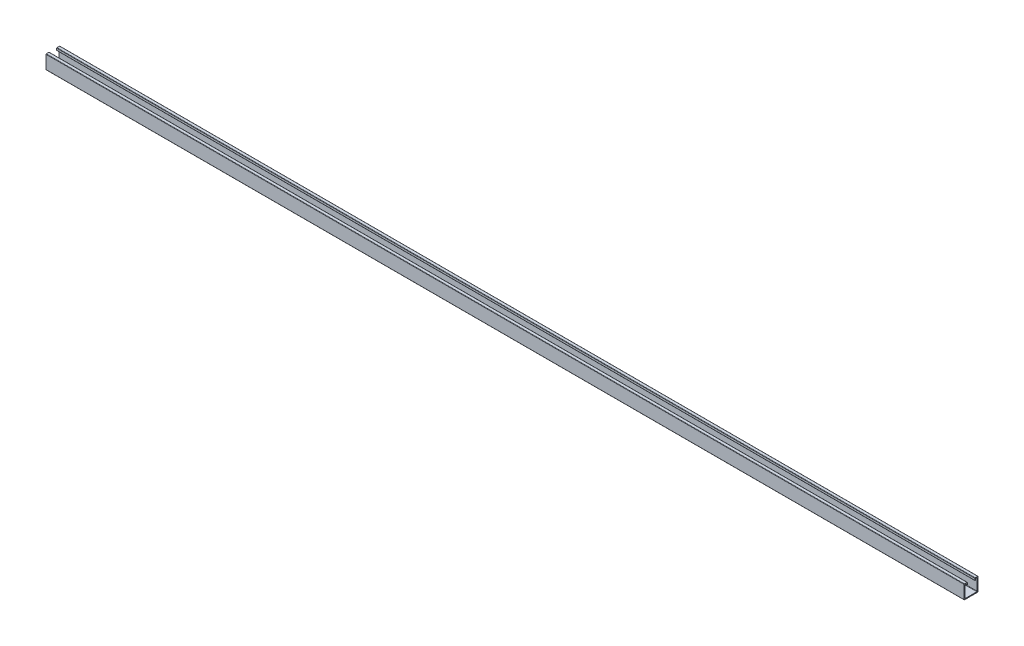
ISO-10303-21;
HEADER;
FILE_DESCRIPTION(('STEP AP214'),'2;1');
FILE_NAME('part.step','',(''),(''),'','','');
FILE_SCHEMA(('AUTOMOTIVE_DESIGN { 1 0 10303 214 1 1 1 1 }'));
ENDSEC;
DATA;
#1=APPLICATION_CONTEXT('core data for automotive mechanical design processes');
#2=APPLICATION_PROTOCOL_DEFINITION('international standard','automotive_design',2000,#1);
#3=PRODUCT_CONTEXT('',#1,'mechanical');
#4=PRODUCT('Part','Part','',(#3));
#5=PRODUCT_RELATED_PRODUCT_CATEGORY('part','',(#4));
#6=PRODUCT_DEFINITION_FORMATION('','',#4);
#7=PRODUCT_DEFINITION_CONTEXT('part definition',#1,'design');
#8=PRODUCT_DEFINITION('design','',#6,#7);
#9=PRODUCT_DEFINITION_SHAPE('','',#8);
#10=(LENGTH_UNIT() NAMED_UNIT(*) SI_UNIT(.MILLI.,.METRE.));
#11=(NAMED_UNIT(*) PLANE_ANGLE_UNIT() SI_UNIT($,.RADIAN.));
#12=(NAMED_UNIT(*) SI_UNIT($,.STERADIAN.) SOLID_ANGLE_UNIT());
#13=UNCERTAINTY_MEASURE_WITH_UNIT(LENGTH_MEASURE(1.E-05),#10,'distance_accuracy_value','');
#14=(GEOMETRIC_REPRESENTATION_CONTEXT(3) GLOBAL_UNCERTAINTY_ASSIGNED_CONTEXT((#13)) GLOBAL_UNIT_ASSIGNED_CONTEXT((#10,
#11,#12)) REPRESENTATION_CONTEXT('',''));
#15=CARTESIAN_POINT('',(0.,0.,0.));
#16=DIRECTION('',(0.,0.,1.));
#17=DIRECTION('',(1.,0.,0.));
#18=AXIS2_PLACEMENT_3D('',#15,#16,#17);
#19=CARTESIAN_POINT('',(2717.8,19.5,-19.5));
#20=DIRECTION('',(-1.,0.,0.));
#21=DIRECTION('',(0.,0.,1.));
#22=AXIS2_PLACEMENT_3D('',#19,#20,#21);
#23=CYLINDRICAL_SURFACE('',#22,1.);
#24=CARTESIAN_POINT('',(0.,19.5,-19.5));
#25=DIRECTION('',(1.,0.,0.));
#26=DIRECTION('',(0.,0.,-1.));
#27=AXIS2_PLACEMENT_3D('',#24,#25,#26);
#28=CIRCLE('',#27,1.);
#29=CARTESIAN_POINT('',(0.,19.5,-20.5));
#30=VERTEX_POINT('',#29);
#31=CARTESIAN_POINT('',(0.,20.5,-19.5));
#32=VERTEX_POINT('',#31);
#33=EDGE_CURVE('E275',#30,#32,#28,.T.);
#34=ORIENTED_EDGE('',*,*,#33,.T.);
#35=DIRECTION('',(-1.,0.,0.));
#36=VECTOR('',#35,1.);
#37=CARTESIAN_POINT('',(2717.8,20.5,-19.5));
#38=LINE('',#37,#36);
#39=CARTESIAN_POINT('',(2717.8,20.5,-19.5));
#40=VERTEX_POINT('',#39);
#41=EDGE_CURVE('E11',#40,#32,#38,.T.);
#42=ORIENTED_EDGE('',*,*,#41,.F.);
#43=CARTESIAN_POINT('',(2717.8,19.5,-19.5));
#44=DIRECTION('',(1.,0.,0.));
#45=DIRECTION('',(0.,0.,-1.));
#46=AXIS2_PLACEMENT_3D('',#43,#44,#45);
#47=CIRCLE('',#46,1.);
#48=CARTESIAN_POINT('',(2717.8,19.5,-20.5));
#49=VERTEX_POINT('',#48);
#50=EDGE_CURVE('E337',#49,#40,#47,.T.);
#51=ORIENTED_EDGE('',*,*,#50,.F.);
#52=DIRECTION('',(-1.,0.,0.));
#53=VECTOR('',#52,1.);
#54=CARTESIAN_POINT('',(2717.8,19.5,-20.5));
#55=LINE('',#54,#53);
#56=EDGE_CURVE('E271',#49,#30,#55,.T.);
#57=ORIENTED_EDGE('',*,*,#56,.T.);
#58=EDGE_LOOP('',(#34,#42,#51,#57));
#59=FACE_BOUND('',#58,.T.);
#60=ADVANCED_FACE('F35',(#59),#23,.T.);
#61=CARTESIAN_POINT('',(2717.8,20.5,-12.));
#62=DIRECTION('',(0.,-1.,0.));
#63=DIRECTION('',(0.,0.,-1.));
#64=AXIS2_PLACEMENT_3D('',#61,#62,#63);
#65=PLANE('',#64);
#66=DIRECTION('',(0.,0.,1.));
#67=VECTOR('',#66,1.);
#68=CARTESIAN_POINT('',(0.,20.5,-12.));
#69=LINE('',#68,#67);
#70=CARTESIAN_POINT('',(0.,20.5,-12.));
#71=VERTEX_POINT('',#70);
#72=EDGE_CURVE('E278',#32,#71,#69,.T.);
#73=ORIENTED_EDGE('',*,*,#72,.T.);
#74=DIRECTION('',(-1.,0.,0.));
#75=VECTOR('',#74,1.);
#76=CARTESIAN_POINT('',(2717.8,20.5,-12.));
#77=LINE('',#76,#75);
#78=CARTESIAN_POINT('',(2717.8,20.5,-12.));
#79=VERTEX_POINT('',#78);
#80=EDGE_CURVE('E43',#79,#71,#77,.T.);
#81=ORIENTED_EDGE('',*,*,#80,.F.);
#82=DIRECTION('',(0.,0.,1.));
#83=VECTOR('',#82,1.);
#84=CARTESIAN_POINT('',(2717.8,20.5,-12.));
#85=LINE('',#84,#83);
#86=EDGE_CURVE('E166',#40,#79,#85,.T.);
#87=ORIENTED_EDGE('',*,*,#86,.F.);
#88=ORIENTED_EDGE('',*,*,#41,.T.);
#89=EDGE_LOOP('',(#73,#81,#87,#88));
#90=FACE_BOUND('',#89,.T.);
#91=ADVANCED_FACE('F515',(#90),#65,.F.);
#92=CARTESIAN_POINT('',(2717.8,19.5,-12.));
#93=DIRECTION('',(-1.,0.,0.));
#94=DIRECTION('',(0.,0.,1.));
#95=AXIS2_PLACEMENT_3D('',#92,#93,#94);
#96=CYLINDRICAL_SURFACE('',#95,1.);
#97=CARTESIAN_POINT('',(0.,19.5,-12.));
#98=DIRECTION('',(1.,0.,0.));
#99=DIRECTION('',(0.,0.,-1.));
#100=AXIS2_PLACEMENT_3D('',#97,#98,#99);
#101=CIRCLE('',#100,1.);
#102=CARTESIAN_POINT('',(0.,19.5,-11.));
#103=VERTEX_POINT('',#102);
#104=EDGE_CURVE('E280',#71,#103,#101,.T.);
#105=ORIENTED_EDGE('',*,*,#104,.T.);
#106=DIRECTION('',(-1.,0.,0.));
#107=VECTOR('',#106,1.);
#108=CARTESIAN_POINT('',(2717.8,19.5,-11.));
#109=LINE('',#108,#107);
#110=CARTESIAN_POINT('',(2717.8,19.5,-11.));
#111=VERTEX_POINT('',#110);
#112=EDGE_CURVE('E416',#111,#103,#109,.T.);
#113=ORIENTED_EDGE('',*,*,#112,.F.);
#114=CARTESIAN_POINT('',(2717.8,19.5,-12.));
#115=DIRECTION('',(1.,0.,0.));
#116=DIRECTION('',(0.,0.,-1.));
#117=AXIS2_PLACEMENT_3D('',#114,#115,#116);
#118=CIRCLE('',#117,1.);
#119=EDGE_CURVE('E424',#79,#111,#118,.T.);
#120=ORIENTED_EDGE('',*,*,#119,.F.);
#121=ORIENTED_EDGE('',*,*,#80,.T.);
#122=EDGE_LOOP('',(#105,#113,#120,#121));
#123=FACE_BOUND('',#122,.T.);
#124=ADVANCED_FACE('F422',(#123),#96,.T.);
#125=CARTESIAN_POINT('',(2717.8,19.5,-11.));
#126=DIRECTION('',(0.,0.,-1.));
#127=DIRECTION('',(0.,1.,0.));
#128=AXIS2_PLACEMENT_3D('',#125,#126,#127);
#129=PLANE('',#128);
#130=DIRECTION('',(0.,-1.,0.));
#131=VECTOR('',#130,1.);
#132=CARTESIAN_POINT('',(0.,19.5,-11.));
#133=LINE('',#132,#131);
#134=CARTESIAN_POINT('',(0.,14.4,-11.));
#135=VERTEX_POINT('',#134);
#136=EDGE_CURVE('E282',#103,#135,#133,.T.);
#137=ORIENTED_EDGE('',*,*,#136,.T.);
#138=DIRECTION('',(-1.,0.,0.));
#139=VECTOR('',#138,1.);
#140=CARTESIAN_POINT('',(2717.8,14.4,-11.));
#141=LINE('',#140,#139);
#142=CARTESIAN_POINT('',(2717.8,14.4,-11.));
#143=VERTEX_POINT('',#142);
#144=EDGE_CURVE('E413',#143,#135,#141,.T.);
#145=ORIENTED_EDGE('',*,*,#144,.F.);
#146=DIRECTION('',(0.,-1.,0.));
#147=VECTOR('',#146,1.);
#148=CARTESIAN_POINT('',(2717.8,19.5,-11.));
#149=LINE('',#148,#147);
#150=EDGE_CURVE('E442',#111,#143,#149,.T.);
#151=ORIENTED_EDGE('',*,*,#150,.F.);
#152=ORIENTED_EDGE('',*,*,#112,.T.);
#153=EDGE_LOOP('',(#137,#145,#151,#152));
#154=FACE_BOUND('',#153,.T.);
#155=ADVANCED_FACE('F433',(#154),#129,.F.);
#156=CARTESIAN_POINT('',(2717.8,14.4,-12.));
#157=DIRECTION('',(-1.,0.,0.));
#158=DIRECTION('',(0.,0.,1.));
#159=AXIS2_PLACEMENT_3D('',#156,#157,#158);
#160=CYLINDRICAL_SURFACE('',#159,0.999999999999999);
#161=CARTESIAN_POINT('',(0.,14.4,-12.));
#162=DIRECTION('',(1.,0.,0.));
#163=DIRECTION('',(0.,0.,1.));
#164=AXIS2_PLACEMENT_3D('',#161,#162,#163);
#165=CIRCLE('',#164,0.999999999999999);
#166=CARTESIAN_POINT('',(0.,13.4,-12.));
#167=VERTEX_POINT('',#166);
#168=EDGE_CURVE('E284',#135,#167,#165,.T.);
#169=ORIENTED_EDGE('',*,*,#168,.T.);
#170=DIRECTION('',(-1.,0.,0.));
#171=VECTOR('',#170,1.);
#172=CARTESIAN_POINT('',(2717.8,13.4,-12.));
#173=LINE('',#172,#171);
#174=CARTESIAN_POINT('',(2717.8,13.4,-12.));
#175=VERTEX_POINT('',#174);
#176=EDGE_CURVE('E410',#175,#167,#173,.T.);
#177=ORIENTED_EDGE('',*,*,#176,.F.);
#178=CARTESIAN_POINT('',(2717.8,14.4,-12.));
#179=DIRECTION('',(1.,0.,0.));
#180=DIRECTION('',(0.,0.,1.));
#181=AXIS2_PLACEMENT_3D('',#178,#179,#180);
#182=CIRCLE('',#181,0.999999999999999);
#183=EDGE_CURVE('E439',#143,#175,#182,.T.);
#184=ORIENTED_EDGE('',*,*,#183,.F.);
#185=ORIENTED_EDGE('',*,*,#144,.T.);
#186=EDGE_LOOP('',(#169,#177,#184,#185));
#187=FACE_BOUND('',#186,.T.);
#188=ADVANCED_FACE('F437',(#187),#160,.T.);
#189=CARTESIAN_POINT('',(2717.8,13.4,-12.));
#190=DIRECTION('',(0.,1.,0.));
#191=DIRECTION('',(0.,0.,1.));
#192=AXIS2_PLACEMENT_3D('',#189,#190,#191);
#193=PLANE('',#192);
#194=DIRECTION('',(0.,0.,-1.));
#195=VECTOR('',#194,1.);
#196=CARTESIAN_POINT('',(0.,13.4,-12.));
#197=LINE('',#196,#195);
#198=CARTESIAN_POINT('',(0.,13.4,-12.5));
#199=VERTEX_POINT('',#198);
#200=EDGE_CURVE('E286',#167,#199,#197,.T.);
#201=ORIENTED_EDGE('',*,*,#200,.T.);
#202=DIRECTION('',(-1.,0.,0.));
#203=VECTOR('',#202,1.);
#204=CARTESIAN_POINT('',(2717.8,13.4,-12.5));
#205=LINE('',#204,#203);
#206=CARTESIAN_POINT('',(2717.8,13.4,-12.5));
#207=VERTEX_POINT('',#206);
#208=EDGE_CURVE('E407',#207,#199,#205,.T.);
#209=ORIENTED_EDGE('',*,*,#208,.F.);
#210=DIRECTION('',(0.,0.,-1.));
#211=VECTOR('',#210,1.);
#212=CARTESIAN_POINT('',(2717.8,13.4,-12.));
#213=LINE('',#212,#211);
#214=EDGE_CURVE('E441',#175,#207,#213,.T.);
#215=ORIENTED_EDGE('',*,*,#214,.F.);
#216=ORIENTED_EDGE('',*,*,#176,.T.);
#217=EDGE_LOOP('',(#201,#209,#215,#216));
#218=FACE_BOUND('',#217,.T.);
#219=ADVANCED_FACE('F528',(#218),#193,.F.);
#220=CARTESIAN_POINT('',(2717.8,14.4,-12.5));
#221=DIRECTION('',(-1.,0.,0.));
#222=DIRECTION('',(0.,0.,1.));
#223=AXIS2_PLACEMENT_3D('',#220,#221,#222);
#224=CYLINDRICAL_SURFACE('',#223,1.);
#225=CARTESIAN_POINT('',(0.,14.4,-12.5));
#226=DIRECTION('',(1.,0.,0.));
#227=DIRECTION('',(0.,0.,-1.));
#228=AXIS2_PLACEMENT_3D('',#225,#226,#227);
#229=CIRCLE('',#228,1.);
#230=CARTESIAN_POINT('',(0.,14.4,-13.5));
#231=VERTEX_POINT('',#230);
#232=EDGE_CURVE('E288',#199,#231,#229,.T.);
#233=ORIENTED_EDGE('',*,*,#232,.T.);
#234=DIRECTION('',(-1.,0.,0.));
#235=VECTOR('',#234,1.);
#236=CARTESIAN_POINT('',(2717.8,14.4,-13.5));
#237=LINE('',#236,#235);
#238=CARTESIAN_POINT('',(2717.8,14.4,-13.5));
#239=VERTEX_POINT('',#238);
#240=EDGE_CURVE('E404',#239,#231,#237,.T.);
#241=ORIENTED_EDGE('',*,*,#240,.F.);
#242=CARTESIAN_POINT('',(2717.8,14.4,-12.5));
#243=DIRECTION('',(1.,0.,0.));
#244=DIRECTION('',(0.,0.,-1.));
#245=AXIS2_PLACEMENT_3D('',#242,#243,#244);
#246=CIRCLE('',#245,1.);
#247=EDGE_CURVE('E444',#207,#239,#246,.T.);
#248=ORIENTED_EDGE('',*,*,#247,.F.);
#249=ORIENTED_EDGE('',*,*,#208,.T.);
#250=EDGE_LOOP('',(#233,#241,#248,#249));
#251=FACE_BOUND('',#250,.T.);
#252=ADVANCED_FACE('F531',(#251),#224,.T.);
#253=CARTESIAN_POINT('',(2717.8,14.4,-13.5));
#254=DIRECTION('',(0.,0.,1.));
#255=DIRECTION('',(1.,0.,0.));
#256=AXIS2_PLACEMENT_3D('',#253,#254,#255);
#257=PLANE('',#256);
#258=DIRECTION('',(0.,1.,0.));
#259=VECTOR('',#258,1.);
#260=CARTESIAN_POINT('',(0.,14.4,-13.5));
#261=LINE('',#260,#259);
#262=CARTESIAN_POINT('',(0.,17.,-13.5));
#263=VERTEX_POINT('',#262);
#264=EDGE_CURVE('E290',#231,#263,#261,.T.);
#265=ORIENTED_EDGE('',*,*,#264,.T.);
#266=DIRECTION('',(-1.,0.,0.));
#267=VECTOR('',#266,1.);
#268=CARTESIAN_POINT('',(2717.8,17.,-13.5));
#269=LINE('',#268,#267);
#270=CARTESIAN_POINT('',(2717.8,17.,-13.5));
#271=VERTEX_POINT('',#270);
#272=EDGE_CURVE('E401',#271,#263,#269,.T.);
#273=ORIENTED_EDGE('',*,*,#272,.F.);
#274=DIRECTION('',(0.,1.,0.));
#275=VECTOR('',#274,1.);
#276=CARTESIAN_POINT('',(2717.8,14.4,-13.5));
#277=LINE('',#276,#275);
#278=EDGE_CURVE('E450',#239,#271,#277,.T.);
#279=ORIENTED_EDGE('',*,*,#278,.F.);
#280=ORIENTED_EDGE('',*,*,#240,.T.);
#281=EDGE_LOOP('',(#265,#273,#279,#280));
#282=FACE_BOUND('',#281,.T.);
#283=ADVANCED_FACE('F535',(#282),#257,.F.);
#284=CARTESIAN_POINT('',(2717.8,17.,-14.5));
#285=DIRECTION('',(-1.,0.,0.));
#286=DIRECTION('',(0.,0.,1.));
#287=AXIS2_PLACEMENT_3D('',#284,#285,#286);
#288=CYLINDRICAL_SURFACE('',#287,0.999999999999998);
#289=CARTESIAN_POINT('',(0.,17.,-14.5));
#290=DIRECTION('',(-1.,0.,0.));
#291=DIRECTION('',(0.,0.,1.));
#292=AXIS2_PLACEMENT_3D('',#289,#290,#291);
#293=CIRCLE('',#292,0.999999999999998);
#294=CARTESIAN_POINT('',(0.,18.,-14.5));
#295=VERTEX_POINT('',#294);
#296=EDGE_CURVE('E292',#263,#295,#293,.T.);
#297=ORIENTED_EDGE('',*,*,#296,.T.);
#298=DIRECTION('',(-1.,0.,0.));
#299=VECTOR('',#298,1.);
#300=CARTESIAN_POINT('',(2717.8,18.,-14.5));
#301=LINE('',#300,#299);
#302=CARTESIAN_POINT('',(2717.8,18.,-14.5));
#303=VERTEX_POINT('',#302);
#304=EDGE_CURVE('E398',#303,#295,#301,.T.);
#305=ORIENTED_EDGE('',*,*,#304,.F.);
#306=CARTESIAN_POINT('',(2717.8,17.,-14.5));
#307=DIRECTION('',(-1.,0.,0.));
#308=DIRECTION('',(0.,0.,1.));
#309=AXIS2_PLACEMENT_3D('',#306,#307,#308);
#310=CIRCLE('',#309,0.999999999999998);
#311=EDGE_CURVE('E452',#271,#303,#310,.T.);
#312=ORIENTED_EDGE('',*,*,#311,.F.);
#313=ORIENTED_EDGE('',*,*,#272,.T.);
#314=EDGE_LOOP('',(#297,#305,#312,#313));
#315=FACE_BOUND('',#314,.T.);
#316=ADVANCED_FACE('F539',(#315),#288,.F.);
#317=CARTESIAN_POINT('',(2717.8,18.,-14.5));
#318=DIRECTION('',(0.,1.,0.));
#319=DIRECTION('',(0.,0.,1.));
#320=AXIS2_PLACEMENT_3D('',#317,#318,#319);
#321=PLANE('',#320);
#322=DIRECTION('',(0.,0.,-1.));
#323=VECTOR('',#322,1.);
#324=CARTESIAN_POINT('',(0.,18.,-14.5));
#325=LINE('',#324,#323);
#326=CARTESIAN_POINT('',(0.,18.,-17.));
#327=VERTEX_POINT('',#326);
#328=EDGE_CURVE('E294',#295,#327,#325,.T.);
#329=ORIENTED_EDGE('',*,*,#328,.T.);
#330=DIRECTION('',(-1.,0.,0.));
#331=VECTOR('',#330,1.);
#332=CARTESIAN_POINT('',(2717.8,18.,-17.));
#333=LINE('',#332,#331);
#334=CARTESIAN_POINT('',(2717.8,18.,-17.));
#335=VERTEX_POINT('',#334);
#336=EDGE_CURVE('E395',#335,#327,#333,.T.);
#337=ORIENTED_EDGE('',*,*,#336,.F.);
#338=DIRECTION('',(0.,0.,-1.));
#339=VECTOR('',#338,1.);
#340=CARTESIAN_POINT('',(2717.8,18.,-14.5));
#341=LINE('',#340,#339);
#342=EDGE_CURVE('E454',#303,#335,#341,.T.);
#343=ORIENTED_EDGE('',*,*,#342,.F.);
#344=ORIENTED_EDGE('',*,*,#304,.T.);
#345=EDGE_LOOP('',(#329,#337,#343,#344));
#346=FACE_BOUND('',#345,.T.);
#347=ADVANCED_FACE('F543',(#346),#321,.F.);
#348=CARTESIAN_POINT('',(2717.8,17.,-17.));
#349=DIRECTION('',(-1.,0.,0.));
#350=DIRECTION('',(0.,0.,1.));
#351=AXIS2_PLACEMENT_3D('',#348,#349,#350);
#352=CYLINDRICAL_SURFACE('',#351,1.);
#353=CARTESIAN_POINT('',(0.,17.,-17.));
#354=DIRECTION('',(-1.,0.,0.));
#355=DIRECTION('',(0.,0.,-1.));
#356=AXIS2_PLACEMENT_3D('',#353,#354,#355);
#357=CIRCLE('',#356,1.);
#358=CARTESIAN_POINT('',(0.,17.,-18.));
#359=VERTEX_POINT('',#358);
#360=EDGE_CURVE('E296',#327,#359,#357,.T.);
#361=ORIENTED_EDGE('',*,*,#360,.T.);
#362=DIRECTION('',(-1.,0.,0.));
#363=VECTOR('',#362,1.);
#364=CARTESIAN_POINT('',(2717.8,17.,-18.));
#365=LINE('',#364,#363);
#366=CARTESIAN_POINT('',(2717.8,17.,-18.));
#367=VERTEX_POINT('',#366);
#368=EDGE_CURVE('E392',#367,#359,#365,.T.);
#369=ORIENTED_EDGE('',*,*,#368,.F.);
#370=CARTESIAN_POINT('',(2717.8,17.,-17.));
#371=DIRECTION('',(-1.,0.,0.));
#372=DIRECTION('',(0.,0.,-1.));
#373=AXIS2_PLACEMENT_3D('',#370,#371,#372);
#374=CIRCLE('',#373,1.);
#375=EDGE_CURVE('E456',#335,#367,#374,.T.);
#376=ORIENTED_EDGE('',*,*,#375,.F.);
#377=ORIENTED_EDGE('',*,*,#336,.T.);
#378=EDGE_LOOP('',(#361,#369,#376,#377));
#379=FACE_BOUND('',#378,.T.);
#380=ADVANCED_FACE('F547',(#379),#352,.F.);
#381=CARTESIAN_POINT('',(2717.8,-17.,-18.));
#382=DIRECTION('',(0.,0.,-1.));
#383=DIRECTION('',(0.,1.,0.));
#384=AXIS2_PLACEMENT_3D('',#381,#382,#383);
#385=PLANE('',#384);
#386=DIRECTION('',(0.,-1.,0.));
#387=VECTOR('',#386,1.);
#388=CARTESIAN_POINT('',(0.,-17.,-18.));
#389=LINE('',#388,#387);
#390=CARTESIAN_POINT('',(0.,-17.,-18.));
#391=VERTEX_POINT('',#390);
#392=EDGE_CURVE('E298',#359,#391,#389,.T.);
#393=ORIENTED_EDGE('',*,*,#392,.T.);
#394=DIRECTION('',(-1.,0.,0.));
#395=VECTOR('',#394,1.);
#396=CARTESIAN_POINT('',(2717.8,-17.,-18.));
#397=LINE('',#396,#395);
#398=CARTESIAN_POINT('',(2717.8,-17.,-18.));
#399=VERTEX_POINT('',#398);
#400=EDGE_CURVE('E389',#399,#391,#397,.T.);
#401=ORIENTED_EDGE('',*,*,#400,.F.);
#402=DIRECTION('',(0.,-1.,0.));
#403=VECTOR('',#402,1.);
#404=CARTESIAN_POINT('',(2717.8,-17.,-18.));
#405=LINE('',#404,#403);
#406=EDGE_CURVE('E458',#367,#399,#405,.T.);
#407=ORIENTED_EDGE('',*,*,#406,.F.);
#408=ORIENTED_EDGE('',*,*,#368,.T.);
#409=EDGE_LOOP('',(#393,#401,#407,#408));
#410=FACE_BOUND('',#409,.T.);
#411=ADVANCED_FACE('F551',(#410),#385,.F.);
#412=CARTESIAN_POINT('',(2717.8,-17.,-17.));
#413=DIRECTION('',(-1.,0.,0.));
#414=DIRECTION('',(0.,0.,1.));
#415=AXIS2_PLACEMENT_3D('',#412,#413,#414);
#416=CYLINDRICAL_SURFACE('',#415,1.);
#417=CARTESIAN_POINT('',(0.,-17.,-17.));
#418=DIRECTION('',(-1.,0.,0.));
#419=DIRECTION('',(0.,0.,1.));
#420=AXIS2_PLACEMENT_3D('',#417,#418,#419);
#421=CIRCLE('',#420,1.);
#422=CARTESIAN_POINT('',(0.,-18.,-17.));
#423=VERTEX_POINT('',#422);
#424=EDGE_CURVE('E300',#391,#423,#421,.T.);
#425=ORIENTED_EDGE('',*,*,#424,.T.);
#426=DIRECTION('',(-1.,0.,0.));
#427=VECTOR('',#426,1.);
#428=CARTESIAN_POINT('',(2717.8,-18.,-17.));
#429=LINE('',#428,#427);
#430=CARTESIAN_POINT('',(2717.8,-18.,-17.));
#431=VERTEX_POINT('',#430);
#432=EDGE_CURVE('E386',#431,#423,#429,.T.);
#433=ORIENTED_EDGE('',*,*,#432,.F.);
#434=CARTESIAN_POINT('',(2717.8,-17.,-17.));
#435=DIRECTION('',(-1.,0.,0.));
#436=DIRECTION('',(0.,0.,1.));
#437=AXIS2_PLACEMENT_3D('',#434,#435,#436);
#438=CIRCLE('',#437,1.);
#439=EDGE_CURVE('E460',#399,#431,#438,.T.);
#440=ORIENTED_EDGE('',*,*,#439,.F.);
#441=ORIENTED_EDGE('',*,*,#400,.T.);
#442=EDGE_LOOP('',(#425,#433,#440,#441));
#443=FACE_BOUND('',#442,.T.);
#444=ADVANCED_FACE('F555',(#443),#416,.F.);
#445=CARTESIAN_POINT('',(2717.8,-18.,17.));
#446=DIRECTION('',(0.,-1.,0.));
#447=DIRECTION('',(0.,0.,-1.));
#448=AXIS2_PLACEMENT_3D('',#445,#446,#447);
#449=PLANE('',#448);
#450=DIRECTION('',(0.,0.,1.));
#451=VECTOR('',#450,1.);
#452=CARTESIAN_POINT('',(0.,-18.,17.));
#453=LINE('',#452,#451);
#454=CARTESIAN_POINT('',(0.,-18.,17.));
#455=VERTEX_POINT('',#454);
#456=EDGE_CURVE('E302',#423,#455,#453,.T.);
#457=ORIENTED_EDGE('',*,*,#456,.T.);
#458=DIRECTION('',(-1.,0.,0.));
#459=VECTOR('',#458,1.);
#460=CARTESIAN_POINT('',(2717.8,-18.,17.));
#461=LINE('',#460,#459);
#462=CARTESIAN_POINT('',(2717.8,-18.,17.));
#463=VERTEX_POINT('',#462);
#464=EDGE_CURVE('E383',#463,#455,#461,.T.);
#465=ORIENTED_EDGE('',*,*,#464,.F.);
#466=DIRECTION('',(0.,0.,1.));
#467=VECTOR('',#466,1.);
#468=CARTESIAN_POINT('',(2717.8,-18.,17.));
#469=LINE('',#468,#467);
#470=EDGE_CURVE('E462',#431,#463,#469,.T.);
#471=ORIENTED_EDGE('',*,*,#470,.F.);
#472=ORIENTED_EDGE('',*,*,#432,.T.);
#473=EDGE_LOOP('',(#457,#465,#471,#472));
#474=FACE_BOUND('',#473,.T.);
#475=ADVANCED_FACE('F559',(#474),#449,.F.);
#476=CARTESIAN_POINT('',(2717.8,-17.,17.));
#477=DIRECTION('',(-1.,0.,0.));
#478=DIRECTION('',(0.,0.,1.));
#479=AXIS2_PLACEMENT_3D('',#476,#477,#478);
#480=CYLINDRICAL_SURFACE('',#479,1.);
#481=CARTESIAN_POINT('',(0.,-17.,17.));
#482=DIRECTION('',(-1.,0.,0.));
#483=DIRECTION('',(0.,0.,1.));
#484=AXIS2_PLACEMENT_3D('',#481,#482,#483);
#485=CIRCLE('',#484,1.);
#486=CARTESIAN_POINT('',(0.,-17.,18.));
#487=VERTEX_POINT('',#486);
#488=EDGE_CURVE('E304',#455,#487,#485,.T.);
#489=ORIENTED_EDGE('',*,*,#488,.T.);
#490=DIRECTION('',(-1.,0.,0.));
#491=VECTOR('',#490,1.);
#492=CARTESIAN_POINT('',(2717.8,-17.,18.));
#493=LINE('',#492,#491);
#494=CARTESIAN_POINT('',(2717.8,-17.,18.));
#495=VERTEX_POINT('',#494);
#496=EDGE_CURVE('E380',#495,#487,#493,.T.);
#497=ORIENTED_EDGE('',*,*,#496,.F.);
#498=CARTESIAN_POINT('',(2717.8,-17.,17.));
#499=DIRECTION('',(-1.,0.,0.));
#500=DIRECTION('',(0.,0.,1.));
#501=AXIS2_PLACEMENT_3D('',#498,#499,#500);
#502=CIRCLE('',#501,1.);
#503=EDGE_CURVE('E464',#463,#495,#502,.T.);
#504=ORIENTED_EDGE('',*,*,#503,.F.);
#505=ORIENTED_EDGE('',*,*,#464,.T.);
#506=EDGE_LOOP('',(#489,#497,#504,#505));
#507=FACE_BOUND('',#506,.T.);
#508=ADVANCED_FACE('F563',(#507),#480,.F.);
#509=CARTESIAN_POINT('',(2717.8,-17.,18.));
#510=DIRECTION('',(0.,0.,1.));
#511=DIRECTION('',(1.,0.,0.));
#512=AXIS2_PLACEMENT_3D('',#509,#510,#511);
#513=PLANE('',#512);
#514=DIRECTION('',(0.,1.,0.));
#515=VECTOR('',#514,1.);
#516=CARTESIAN_POINT('',(0.,-17.,18.));
#517=LINE('',#516,#515);
#518=CARTESIAN_POINT('',(0.,17.,18.));
#519=VERTEX_POINT('',#518);
#520=EDGE_CURVE('E306',#487,#519,#517,.T.);
#521=ORIENTED_EDGE('',*,*,#520,.T.);
#522=DIRECTION('',(-1.,0.,0.));
#523=VECTOR('',#522,1.);
#524=CARTESIAN_POINT('',(2717.8,17.,18.));
#525=LINE('',#524,#523);
#526=CARTESIAN_POINT('',(2717.8,17.,18.));
#527=VERTEX_POINT('',#526);
#528=EDGE_CURVE('E377',#527,#519,#525,.T.);
#529=ORIENTED_EDGE('',*,*,#528,.F.);
#530=DIRECTION('',(0.,1.,0.));
#531=VECTOR('',#530,1.);
#532=CARTESIAN_POINT('',(2717.8,-17.,18.));
#533=LINE('',#532,#531);
#534=EDGE_CURVE('E466',#495,#527,#533,.T.);
#535=ORIENTED_EDGE('',*,*,#534,.F.);
#536=ORIENTED_EDGE('',*,*,#496,.T.);
#537=EDGE_LOOP('',(#521,#529,#535,#536));
#538=FACE_BOUND('',#537,.T.);
#539=ADVANCED_FACE('F567',(#538),#513,.F.);
#540=CARTESIAN_POINT('',(2717.8,17.,17.));
#541=DIRECTION('',(-1.,0.,0.));
#542=DIRECTION('',(0.,0.,1.));
#543=AXIS2_PLACEMENT_3D('',#540,#541,#542);
#544=CYLINDRICAL_SURFACE('',#543,1.);
#545=CARTESIAN_POINT('',(0.,17.,17.));
#546=DIRECTION('',(-1.,0.,0.));
#547=DIRECTION('',(0.,0.,-1.));
#548=AXIS2_PLACEMENT_3D('',#545,#546,#547);
#549=CIRCLE('',#548,1.);
#550=CARTESIAN_POINT('',(0.,18.,17.));
#551=VERTEX_POINT('',#550);
#552=EDGE_CURVE('E308',#519,#551,#549,.T.);
#553=ORIENTED_EDGE('',*,*,#552,.T.);
#554=DIRECTION('',(-1.,0.,0.));
#555=VECTOR('',#554,1.);
#556=CARTESIAN_POINT('',(2717.8,18.,17.));
#557=LINE('',#556,#555);
#558=CARTESIAN_POINT('',(2717.8,18.,17.));
#559=VERTEX_POINT('',#558);
#560=EDGE_CURVE('E374',#559,#551,#557,.T.);
#561=ORIENTED_EDGE('',*,*,#560,.F.);
#562=CARTESIAN_POINT('',(2717.8,17.,17.));
#563=DIRECTION('',(-1.,0.,0.));
#564=DIRECTION('',(0.,0.,-1.));
#565=AXIS2_PLACEMENT_3D('',#562,#563,#564);
#566=CIRCLE('',#565,1.);
#567=EDGE_CURVE('E468',#527,#559,#566,.T.);
#568=ORIENTED_EDGE('',*,*,#567,.F.);
#569=ORIENTED_EDGE('',*,*,#528,.T.);
#570=EDGE_LOOP('',(#553,#561,#568,#569));
#571=FACE_BOUND('',#570,.T.);
#572=ADVANCED_FACE('F571',(#571),#544,.F.);
#573=CARTESIAN_POINT('',(2717.8,18.,17.));
#574=DIRECTION('',(0.,1.,0.));
#575=DIRECTION('',(0.,0.,1.));
#576=AXIS2_PLACEMENT_3D('',#573,#574,#575);
#577=PLANE('',#576);
#578=DIRECTION('',(0.,0.,-1.));
#579=VECTOR('',#578,1.);
#580=CARTESIAN_POINT('',(0.,18.,17.));
#581=LINE('',#580,#579);
#582=CARTESIAN_POINT('',(0.,18.,14.5));
#583=VERTEX_POINT('',#582);
#584=EDGE_CURVE('E310',#551,#583,#581,.T.);
#585=ORIENTED_EDGE('',*,*,#584,.T.);
#586=DIRECTION('',(-1.,0.,0.));
#587=VECTOR('',#586,1.);
#588=CARTESIAN_POINT('',(2717.8,18.,14.5));
#589=LINE('',#588,#587);
#590=CARTESIAN_POINT('',(2717.8,18.,14.5));
#591=VERTEX_POINT('',#590);
#592=EDGE_CURVE('E371',#591,#583,#589,.T.);
#593=ORIENTED_EDGE('',*,*,#592,.F.);
#594=DIRECTION('',(0.,0.,-1.));
#595=VECTOR('',#594,1.);
#596=CARTESIAN_POINT('',(2717.8,18.,17.));
#597=LINE('',#596,#595);
#598=EDGE_CURVE('E470',#559,#591,#597,.T.);
#599=ORIENTED_EDGE('',*,*,#598,.F.);
#600=ORIENTED_EDGE('',*,*,#560,.T.);
#601=EDGE_LOOP('',(#585,#593,#599,#600));
#602=FACE_BOUND('',#601,.T.);
#603=ADVANCED_FACE('F575',(#602),#577,.F.);
#604=CARTESIAN_POINT('',(2717.8,17.,14.5));
#605=DIRECTION('',(-1.,0.,0.));
#606=DIRECTION('',(0.,0.,1.));
#607=AXIS2_PLACEMENT_3D('',#604,#605,#606);
#608=CYLINDRICAL_SURFACE('',#607,1.);
#609=CARTESIAN_POINT('',(0.,17.,14.5));
#610=DIRECTION('',(-1.,0.,0.));
#611=DIRECTION('',(0.,0.,1.));
#612=AXIS2_PLACEMENT_3D('',#609,#610,#611);
#613=CIRCLE('',#612,1.);
#614=CARTESIAN_POINT('',(0.,17.,13.5));
#615=VERTEX_POINT('',#614);
#616=EDGE_CURVE('E312',#583,#615,#613,.T.);
#617=ORIENTED_EDGE('',*,*,#616,.T.);
#618=DIRECTION('',(-1.,0.,0.));
#619=VECTOR('',#618,1.);
#620=CARTESIAN_POINT('',(2717.8,17.,13.5));
#621=LINE('',#620,#619);
#622=CARTESIAN_POINT('',(2717.8,17.,13.5));
#623=VERTEX_POINT('',#622);
#624=EDGE_CURVE('E368',#623,#615,#621,.T.);
#625=ORIENTED_EDGE('',*,*,#624,.F.);
#626=CARTESIAN_POINT('',(2717.8,17.,14.5));
#627=DIRECTION('',(-1.,0.,0.));
#628=DIRECTION('',(0.,0.,1.));
#629=AXIS2_PLACEMENT_3D('',#626,#627,#628);
#630=CIRCLE('',#629,1.);
#631=EDGE_CURVE('E472',#591,#623,#630,.T.);
#632=ORIENTED_EDGE('',*,*,#631,.F.);
#633=ORIENTED_EDGE('',*,*,#592,.T.);
#634=EDGE_LOOP('',(#617,#625,#632,#633));
#635=FACE_BOUND('',#634,.T.);
#636=ADVANCED_FACE('F579',(#635),#608,.F.);
#637=CARTESIAN_POINT('',(2717.8,17.,13.5));
#638=DIRECTION('',(0.,0.,-1.));
#639=DIRECTION('',(-1.,0.,0.));
#640=AXIS2_PLACEMENT_3D('',#637,#638,#639);
#641=PLANE('',#640);
#642=DIRECTION('',(0.,-1.,0.));
#643=VECTOR('',#642,1.);
#644=CARTESIAN_POINT('',(0.,17.,13.5));
#645=LINE('',#644,#643);
#646=CARTESIAN_POINT('',(0.,14.4,13.5));
#647=VERTEX_POINT('',#646);
#648=EDGE_CURVE('E314',#615,#647,#645,.T.);
#649=ORIENTED_EDGE('',*,*,#648,.T.);
#650=DIRECTION('',(-1.,0.,0.));
#651=VECTOR('',#650,1.);
#652=CARTESIAN_POINT('',(2717.8,14.4,13.5));
#653=LINE('',#652,#651);
#654=CARTESIAN_POINT('',(2717.8,14.4,13.5));
#655=VERTEX_POINT('',#654);
#656=EDGE_CURVE('E365',#655,#647,#653,.T.);
#657=ORIENTED_EDGE('',*,*,#656,.F.);
#658=DIRECTION('',(0.,-1.,0.));
#659=VECTOR('',#658,1.);
#660=CARTESIAN_POINT('',(2717.8,17.,13.5));
#661=LINE('',#660,#659);
#662=EDGE_CURVE('E474',#623,#655,#661,.T.);
#663=ORIENTED_EDGE('',*,*,#662,.F.);
#664=ORIENTED_EDGE('',*,*,#624,.T.);
#665=EDGE_LOOP('',(#649,#657,#663,#664));
#666=FACE_BOUND('',#665,.T.);
#667=ADVANCED_FACE('F583',(#666),#641,.F.);
#668=CARTESIAN_POINT('',(2717.8,14.4,12.5));
#669=DIRECTION('',(-1.,0.,0.));
#670=DIRECTION('',(0.,0.,1.));
#671=AXIS2_PLACEMENT_3D('',#668,#669,#670);
#672=CYLINDRICAL_SURFACE('',#671,1.);
#673=CARTESIAN_POINT('',(0.,14.4,12.5));
#674=DIRECTION('',(1.,0.,0.));
#675=DIRECTION('',(0.,0.,1.));
#676=AXIS2_PLACEMENT_3D('',#673,#674,#675);
#677=CIRCLE('',#676,1.);
#678=CARTESIAN_POINT('',(0.,13.4,12.5));
#679=VERTEX_POINT('',#678);
#680=EDGE_CURVE('E316',#647,#679,#677,.T.);
#681=ORIENTED_EDGE('',*,*,#680,.T.);
#682=DIRECTION('',(-1.,0.,0.));
#683=VECTOR('',#682,1.);
#684=CARTESIAN_POINT('',(2717.8,13.4,12.5));
#685=LINE('',#684,#683);
#686=CARTESIAN_POINT('',(2717.8,13.4,12.5));
#687=VERTEX_POINT('',#686);
#688=EDGE_CURVE('E362',#687,#679,#685,.T.);
#689=ORIENTED_EDGE('',*,*,#688,.F.);
#690=CARTESIAN_POINT('',(2717.8,14.4,12.5));
#691=DIRECTION('',(1.,0.,0.));
#692=DIRECTION('',(0.,0.,1.));
#693=AXIS2_PLACEMENT_3D('',#690,#691,#692);
#694=CIRCLE('',#693,1.);
#695=EDGE_CURVE('E476',#655,#687,#694,.T.);
#696=ORIENTED_EDGE('',*,*,#695,.F.);
#697=ORIENTED_EDGE('',*,*,#656,.T.);
#698=EDGE_LOOP('',(#681,#689,#696,#697));
#699=FACE_BOUND('',#698,.T.);
#700=ADVANCED_FACE('F587',(#699),#672,.T.);
#701=CARTESIAN_POINT('',(2717.8,13.4,12.));
#702=DIRECTION('',(0.,1.,0.));
#703=DIRECTION('',(0.,0.,1.));
#704=AXIS2_PLACEMENT_3D('',#701,#702,#703);
#705=PLANE('',#704);
#706=DIRECTION('',(0.,0.,-1.));
#707=VECTOR('',#706,1.);
#708=CARTESIAN_POINT('',(0.,13.4,12.));
#709=LINE('',#708,#707);
#710=CARTESIAN_POINT('',(0.,13.4,12.));
#711=VERTEX_POINT('',#710);
#712=EDGE_CURVE('E318',#679,#711,#709,.T.);
#713=ORIENTED_EDGE('',*,*,#712,.T.);
#714=DIRECTION('',(-1.,0.,0.));
#715=VECTOR('',#714,1.);
#716=CARTESIAN_POINT('',(2717.8,13.4,12.));
#717=LINE('',#716,#715);
#718=CARTESIAN_POINT('',(2717.8,13.4,12.));
#719=VERTEX_POINT('',#718);
#720=EDGE_CURVE('E359',#719,#711,#717,.T.);
#721=ORIENTED_EDGE('',*,*,#720,.F.);
#722=DIRECTION('',(0.,0.,-1.));
#723=VECTOR('',#722,1.);
#724=CARTESIAN_POINT('',(2717.8,13.4,12.));
#725=LINE('',#724,#723);
#726=EDGE_CURVE('E478',#687,#719,#725,.T.);
#727=ORIENTED_EDGE('',*,*,#726,.F.);
#728=ORIENTED_EDGE('',*,*,#688,.T.);
#729=EDGE_LOOP('',(#713,#721,#727,#728));
#730=FACE_BOUND('',#729,.T.);
#731=ADVANCED_FACE('F591',(#730),#705,.F.);
#732=CARTESIAN_POINT('',(2717.8,14.4,12.));
#733=DIRECTION('',(-1.,0.,0.));
#734=DIRECTION('',(0.,0.,1.));
#735=AXIS2_PLACEMENT_3D('',#732,#733,#734);
#736=CYLINDRICAL_SURFACE('',#735,1.);
#737=CARTESIAN_POINT('',(0.,14.4,12.));
#738=DIRECTION('',(1.,0.,0.));
#739=DIRECTION('',(0.,0.,-1.));
#740=AXIS2_PLACEMENT_3D('',#737,#738,#739);
#741=CIRCLE('',#740,1.);
#742=CARTESIAN_POINT('',(0.,14.4,11.));
#743=VERTEX_POINT('',#742);
#744=EDGE_CURVE('E320',#711,#743,#741,.T.);
#745=ORIENTED_EDGE('',*,*,#744,.T.);
#746=DIRECTION('',(-1.,0.,0.));
#747=VECTOR('',#746,1.);
#748=CARTESIAN_POINT('',(2717.8,14.4,11.));
#749=LINE('',#748,#747);
#750=CARTESIAN_POINT('',(2717.8,14.4,11.));
#751=VERTEX_POINT('',#750);
#752=EDGE_CURVE('E356',#751,#743,#749,.T.);
#753=ORIENTED_EDGE('',*,*,#752,.F.);
#754=CARTESIAN_POINT('',(2717.8,14.4,12.));
#755=DIRECTION('',(1.,0.,0.));
#756=DIRECTION('',(0.,0.,-1.));
#757=AXIS2_PLACEMENT_3D('',#754,#755,#756);
#758=CIRCLE('',#757,1.);
#759=EDGE_CURVE('E480',#719,#751,#758,.T.);
#760=ORIENTED_EDGE('',*,*,#759,.F.);
#761=ORIENTED_EDGE('',*,*,#720,.T.);
#762=EDGE_LOOP('',(#745,#753,#760,#761));
#763=FACE_BOUND('',#762,.T.);
#764=ADVANCED_FACE('F595',(#763),#736,.T.);
#765=CARTESIAN_POINT('',(2717.8,19.5,11.));
#766=DIRECTION('',(0.,0.,1.));
#767=DIRECTION('',(0.,-1.,0.));
#768=AXIS2_PLACEMENT_3D('',#765,#766,#767);
#769=PLANE('',#768);
#770=DIRECTION('',(0.,1.,0.));
#771=VECTOR('',#770,1.);
#772=CARTESIAN_POINT('',(0.,19.5,11.));
#773=LINE('',#772,#771);
#774=CARTESIAN_POINT('',(0.,19.5,11.));
#775=VERTEX_POINT('',#774);
#776=EDGE_CURVE('E322',#743,#775,#773,.T.);
#777=ORIENTED_EDGE('',*,*,#776,.T.);
#778=DIRECTION('',(-1.,0.,0.));
#779=VECTOR('',#778,1.);
#780=CARTESIAN_POINT('',(2717.8,19.5,11.));
#781=LINE('',#780,#779);
#782=CARTESIAN_POINT('',(2717.8,19.5,11.));
#783=VERTEX_POINT('',#782);
#784=EDGE_CURVE('E353',#783,#775,#781,.T.);
#785=ORIENTED_EDGE('',*,*,#784,.F.);
#786=DIRECTION('',(0.,1.,0.));
#787=VECTOR('',#786,1.);
#788=CARTESIAN_POINT('',(2717.8,19.5,11.));
#789=LINE('',#788,#787);
#790=EDGE_CURVE('E482',#751,#783,#789,.T.);
#791=ORIENTED_EDGE('',*,*,#790,.F.);
#792=ORIENTED_EDGE('',*,*,#752,.T.);
#793=EDGE_LOOP('',(#777,#785,#791,#792));
#794=FACE_BOUND('',#793,.T.);
#795=ADVANCED_FACE('F599',(#794),#769,.F.);
#796=CARTESIAN_POINT('',(2717.8,19.5,12.));
#797=DIRECTION('',(-1.,0.,0.));
#798=DIRECTION('',(0.,0.,1.));
#799=AXIS2_PLACEMENT_3D('',#796,#797,#798);
#800=CYLINDRICAL_SURFACE('',#799,1.);
#801=CARTESIAN_POINT('',(0.,19.5,12.));
#802=DIRECTION('',(1.,0.,0.));
#803=DIRECTION('',(0.,0.,-1.));
#804=AXIS2_PLACEMENT_3D('',#801,#802,#803);
#805=CIRCLE('',#804,1.);
#806=CARTESIAN_POINT('',(0.,20.5,12.));
#807=VERTEX_POINT('',#806);
#808=EDGE_CURVE('E324',#775,#807,#805,.T.);
#809=ORIENTED_EDGE('',*,*,#808,.T.);
#810=DIRECTION('',(-1.,0.,0.));
#811=VECTOR('',#810,1.);
#812=CARTESIAN_POINT('',(2717.8,20.5,12.));
#813=LINE('',#812,#811);
#814=CARTESIAN_POINT('',(2717.8,20.5,12.));
#815=VERTEX_POINT('',#814);
#816=EDGE_CURVE('E350',#815,#807,#813,.T.);
#817=ORIENTED_EDGE('',*,*,#816,.F.);
#818=CARTESIAN_POINT('',(2717.8,19.5,12.));
#819=DIRECTION('',(1.,0.,0.));
#820=DIRECTION('',(0.,0.,-1.));
#821=AXIS2_PLACEMENT_3D('',#818,#819,#820);
#822=CIRCLE('',#821,1.);
#823=EDGE_CURVE('E484',#783,#815,#822,.T.);
#824=ORIENTED_EDGE('',*,*,#823,.F.);
#825=ORIENTED_EDGE('',*,*,#784,.T.);
#826=EDGE_LOOP('',(#809,#817,#824,#825));
#827=FACE_BOUND('',#826,.T.);
#828=ADVANCED_FACE('F603',(#827),#800,.T.);
#829=CARTESIAN_POINT('',(2717.8,20.5,19.5));
#830=DIRECTION('',(0.,-1.,0.));
#831=DIRECTION('',(0.,0.,-1.));
#832=AXIS2_PLACEMENT_3D('',#829,#830,#831);
#833=PLANE('',#832);
#834=DIRECTION('',(0.,0.,1.));
#835=VECTOR('',#834,1.);
#836=CARTESIAN_POINT('',(0.,20.5,19.5));
#837=LINE('',#836,#835);
#838=CARTESIAN_POINT('',(0.,20.5,19.5));
#839=VERTEX_POINT('',#838);
#840=EDGE_CURVE('E326',#807,#839,#837,.T.);
#841=ORIENTED_EDGE('',*,*,#840,.T.);
#842=DIRECTION('',(-1.,0.,0.));
#843=VECTOR('',#842,1.);
#844=CARTESIAN_POINT('',(2717.8,20.5,19.5));
#845=LINE('',#844,#843);
#846=CARTESIAN_POINT('',(2717.8,20.5,19.5));
#847=VERTEX_POINT('',#846);
#848=EDGE_CURVE('E347',#847,#839,#845,.T.);
#849=ORIENTED_EDGE('',*,*,#848,.F.);
#850=DIRECTION('',(0.,0.,1.));
#851=VECTOR('',#850,1.);
#852=CARTESIAN_POINT('',(2717.8,20.5,19.5));
#853=LINE('',#852,#851);
#854=EDGE_CURVE('E486',#815,#847,#853,.T.);
#855=ORIENTED_EDGE('',*,*,#854,.F.);
#856=ORIENTED_EDGE('',*,*,#816,.T.);
#857=EDGE_LOOP('',(#841,#849,#855,#856));
#858=FACE_BOUND('',#857,.T.);
#859=ADVANCED_FACE('F607',(#858),#833,.F.);
#860=CARTESIAN_POINT('',(2717.8,19.5,19.5));
#861=DIRECTION('',(-1.,0.,0.));
#862=DIRECTION('',(0.,0.,1.));
#863=AXIS2_PLACEMENT_3D('',#860,#861,#862);
#864=CYLINDRICAL_SURFACE('',#863,1.);
#865=CARTESIAN_POINT('',(0.,19.5,19.5));
#866=DIRECTION('',(1.,0.,0.));
#867=DIRECTION('',(0.,0.,-1.));
#868=AXIS2_PLACEMENT_3D('',#865,#866,#867);
#869=CIRCLE('',#868,1.);
#870=CARTESIAN_POINT('',(0.,19.5,20.5));
#871=VERTEX_POINT('',#870);
#872=EDGE_CURVE('E328',#839,#871,#869,.T.);
#873=ORIENTED_EDGE('',*,*,#872,.T.);
#874=DIRECTION('',(-1.,0.,0.));
#875=VECTOR('',#874,1.);
#876=CARTESIAN_POINT('',(2717.8,19.5,20.5));
#877=LINE('',#876,#875);
#878=CARTESIAN_POINT('',(2717.8,19.5,20.5));
#879=VERTEX_POINT('',#878);
#880=EDGE_CURVE('E344',#879,#871,#877,.T.);
#881=ORIENTED_EDGE('',*,*,#880,.F.);
#882=CARTESIAN_POINT('',(2717.8,19.5,19.5));
#883=DIRECTION('',(1.,0.,0.));
#884=DIRECTION('',(0.,0.,-1.));
#885=AXIS2_PLACEMENT_3D('',#882,#883,#884);
#886=CIRCLE('',#885,1.);
#887=EDGE_CURVE('E488',#847,#879,#886,.T.);
#888=ORIENTED_EDGE('',*,*,#887,.F.);
#889=ORIENTED_EDGE('',*,*,#848,.T.);
#890=EDGE_LOOP('',(#873,#881,#888,#889));
#891=FACE_BOUND('',#890,.T.);
#892=ADVANCED_FACE('F611',(#891),#864,.T.);
#893=CARTESIAN_POINT('',(2717.8,-19.5,20.5));
#894=DIRECTION('',(0.,0.,-1.));
#895=DIRECTION('',(-1.,0.,0.));
#896=AXIS2_PLACEMENT_3D('',#893,#894,#895);
#897=PLANE('',#896);
#898=DIRECTION('',(0.,-1.,0.));
#899=VECTOR('',#898,1.);
#900=CARTESIAN_POINT('',(0.,-19.5,20.5));
#901=LINE('',#900,#899);
#902=CARTESIAN_POINT('',(0.,-19.5,20.5));
#903=VERTEX_POINT('',#902);
#904=EDGE_CURVE('E330',#871,#903,#901,.T.);
#905=ORIENTED_EDGE('',*,*,#904,.T.);
#906=DIRECTION('',(-1.,0.,0.));
#907=VECTOR('',#906,1.);
#908=CARTESIAN_POINT('',(2717.8,-19.5,20.5));
#909=LINE('',#908,#907);
#910=CARTESIAN_POINT('',(2717.8,-19.5,20.5));
#911=VERTEX_POINT('',#910);
#912=EDGE_CURVE('E341',#911,#903,#909,.T.);
#913=ORIENTED_EDGE('',*,*,#912,.F.);
#914=DIRECTION('',(0.,-1.,0.));
#915=VECTOR('',#914,1.);
#916=CARTESIAN_POINT('',(2717.8,-19.5,20.5));
#917=LINE('',#916,#915);
#918=EDGE_CURVE('E490',#879,#911,#917,.T.);
#919=ORIENTED_EDGE('',*,*,#918,.F.);
#920=ORIENTED_EDGE('',*,*,#880,.T.);
#921=EDGE_LOOP('',(#905,#913,#919,#920));
#922=FACE_BOUND('',#921,.T.);
#923=ADVANCED_FACE('F496',(#922),#897,.F.);
#924=CARTESIAN_POINT('',(2717.8,-19.5,19.5));
#925=DIRECTION('',(-1.,0.,0.));
#926=DIRECTION('',(0.,0.,1.));
#927=AXIS2_PLACEMENT_3D('',#924,#925,#926);
#928=CYLINDRICAL_SURFACE('',#927,1.);
#929=CARTESIAN_POINT('',(0.,-19.5,19.5));
#930=DIRECTION('',(1.,0.,0.));
#931=DIRECTION('',(0.,0.,-1.));
#932=AXIS2_PLACEMENT_3D('',#929,#930,#931);
#933=CIRCLE('',#932,1.);
#934=CARTESIAN_POINT('',(0.,-20.5,19.5));
#935=VERTEX_POINT('',#934);
#936=EDGE_CURVE('E332',#903,#935,#933,.T.);
#937=ORIENTED_EDGE('',*,*,#936,.T.);
#938=DIRECTION('',(-1.,0.,0.));
#939=VECTOR('',#938,1.);
#940=CARTESIAN_POINT('',(2717.8,-20.5,19.5));
#941=LINE('',#940,#939);
#942=CARTESIAN_POINT('',(2717.8,-20.5,19.5));
#943=VERTEX_POINT('',#942);
#944=EDGE_CURVE('E266',#943,#935,#941,.T.);
#945=ORIENTED_EDGE('',*,*,#944,.F.);
#946=CARTESIAN_POINT('',(2717.8,-19.5,19.5));
#947=DIRECTION('',(1.,0.,0.));
#948=DIRECTION('',(0.,0.,-1.));
#949=AXIS2_PLACEMENT_3D('',#946,#947,#948);
#950=CIRCLE('',#949,1.);
#951=EDGE_CURVE('E257',#911,#943,#950,.T.);
#952=ORIENTED_EDGE('',*,*,#951,.F.);
#953=ORIENTED_EDGE('',*,*,#912,.T.);
#954=EDGE_LOOP('',(#937,#945,#952,#953));
#955=FACE_BOUND('',#954,.T.);
#956=ADVANCED_FACE('F500',(#955),#928,.T.);
#957=CARTESIAN_POINT('',(2717.8,-20.5,19.5));
#958=DIRECTION('',(0.,1.,0.));
#959=DIRECTION('',(0.,0.,1.));
#960=AXIS2_PLACEMENT_3D('',#957,#958,#959);
#961=PLANE('',#960);
#962=DIRECTION('',(0.,0.,-1.));
#963=VECTOR('',#962,1.);
#964=CARTESIAN_POINT('',(0.,-20.5,19.5));
#965=LINE('',#964,#963);
#966=CARTESIAN_POINT('',(0.,-20.5,-19.5));
#967=VERTEX_POINT('',#966);
#968=EDGE_CURVE('E265',#935,#967,#965,.T.);
#969=ORIENTED_EDGE('',*,*,#968,.T.);
#970=DIRECTION('',(-1.,0.,0.));
#971=VECTOR('',#970,1.);
#972=CARTESIAN_POINT('',(2717.8,-20.5,-19.5));
#973=LINE('',#972,#971);
#974=CARTESIAN_POINT('',(2717.8,-20.5,-19.5));
#975=VERTEX_POINT('',#974);
#976=EDGE_CURVE('E262',#975,#967,#973,.T.);
#977=ORIENTED_EDGE('',*,*,#976,.F.);
#978=DIRECTION('',(0.,0.,-1.));
#979=VECTOR('',#978,1.);
#980=CARTESIAN_POINT('',(2717.8,-20.5,19.5));
#981=LINE('',#980,#979);
#982=EDGE_CURVE('E251',#943,#975,#981,.T.);
#983=ORIENTED_EDGE('',*,*,#982,.F.);
#984=ORIENTED_EDGE('',*,*,#944,.T.);
#985=EDGE_LOOP('',(#969,#977,#983,#984));
#986=FACE_BOUND('',#985,.T.);
#987=ADVANCED_FACE('F263',(#986),#961,.F.);
#988=CARTESIAN_POINT('',(2717.8,-19.5,-19.5));
#989=DIRECTION('',(-1.,0.,0.));
#990=DIRECTION('',(0.,0.,1.));
#991=AXIS2_PLACEMENT_3D('',#988,#989,#990);
#992=CYLINDRICAL_SURFACE('',#991,1.);
#993=CARTESIAN_POINT('',(0.,-19.5,-19.5));
#994=DIRECTION('',(1.,0.,0.));
#995=DIRECTION('',(0.,0.,1.));
#996=AXIS2_PLACEMENT_3D('',#993,#994,#995);
#997=CIRCLE('',#996,1.);
#998=CARTESIAN_POINT('',(0.,-19.5,-20.5));
#999=VERTEX_POINT('',#998);
#1000=EDGE_CURVE('E152',#967,#999,#997,.T.);
#1001=ORIENTED_EDGE('',*,*,#1000,.T.);
#1002=DIRECTION('',(-1.,0.,0.));
#1003=VECTOR('',#1002,1.);
#1004=CARTESIAN_POINT('',(2717.8,-19.5,-20.5));
#1005=LINE('',#1004,#1003);
#1006=CARTESIAN_POINT('',(2717.8,-19.5,-20.5));
#1007=VERTEX_POINT('',#1006);
#1008=EDGE_CURVE('E267',#1007,#999,#1005,.T.);
#1009=ORIENTED_EDGE('',*,*,#1008,.F.);
#1010=CARTESIAN_POINT('',(2717.8,-19.5,-19.5));
#1011=DIRECTION('',(1.,0.,0.));
#1012=DIRECTION('',(0.,0.,1.));
#1013=AXIS2_PLACEMENT_3D('',#1010,#1011,#1012);
#1014=CIRCLE('',#1013,1.);
#1015=EDGE_CURVE('E255',#975,#1007,#1014,.T.);
#1016=ORIENTED_EDGE('',*,*,#1015,.F.);
#1017=ORIENTED_EDGE('',*,*,#976,.T.);
#1018=EDGE_LOOP('',(#1001,#1009,#1016,#1017));
#1019=FACE_BOUND('',#1018,.T.);
#1020=ADVANCED_FACE('F269',(#1019),#992,.T.);
#1021=CARTESIAN_POINT('',(2717.8,-19.5,-20.5));
#1022=DIRECTION('',(0.,0.,1.));
#1023=DIRECTION('',(1.,0.,0.));
#1024=AXIS2_PLACEMENT_3D('',#1021,#1022,#1023);
#1025=PLANE('',#1024);
#1026=DIRECTION('',(0.,1.,0.));
#1027=VECTOR('',#1026,1.);
#1028=CARTESIAN_POINT('',(0.,-19.5,-20.5));
#1029=LINE('',#1028,#1027);
#1030=EDGE_CURVE('E158',#999,#30,#1029,.T.);
#1031=ORIENTED_EDGE('',*,*,#1030,.T.);
#1032=ORIENTED_EDGE('',*,*,#56,.F.);
#1033=DIRECTION('',(0.,1.,0.));
#1034=VECTOR('',#1033,1.);
#1035=CARTESIAN_POINT('',(2717.8,-19.5,-20.5));
#1036=LINE('',#1035,#1034);
#1037=EDGE_CURVE('E51',#1007,#49,#1036,.T.);
#1038=ORIENTED_EDGE('',*,*,#1037,.F.);
#1039=ORIENTED_EDGE('',*,*,#1008,.T.);
#1040=EDGE_LOOP('',(#1031,#1032,#1038,#1039));
#1041=FACE_BOUND('',#1040,.T.);
#1042=ADVANCED_FACE('F504',(#1041),#1025,.F.);
#1043=CARTESIAN_POINT('',(2717.8,19.5,-19.5));
#1044=DIRECTION('',(1.,0.,0.));
#1045=DIRECTION('',(0.,0.,-1.));
#1046=AXIS2_PLACEMENT_3D('',#1043,#1044,#1045);
#1047=PLANE('',#1046);
#1048=ORIENTED_EDGE('',*,*,#50,.T.);
#1049=ORIENTED_EDGE('',*,*,#86,.T.);
#1050=ORIENTED_EDGE('',*,*,#119,.T.);
#1051=ORIENTED_EDGE('',*,*,#150,.T.);
#1052=ORIENTED_EDGE('',*,*,#183,.T.);
#1053=ORIENTED_EDGE('',*,*,#214,.T.);
#1054=ORIENTED_EDGE('',*,*,#247,.T.);
#1055=ORIENTED_EDGE('',*,*,#278,.T.);
#1056=ORIENTED_EDGE('',*,*,#311,.T.);
#1057=ORIENTED_EDGE('',*,*,#342,.T.);
#1058=ORIENTED_EDGE('',*,*,#375,.T.);
#1059=ORIENTED_EDGE('',*,*,#406,.T.);
#1060=ORIENTED_EDGE('',*,*,#439,.T.);
#1061=ORIENTED_EDGE('',*,*,#470,.T.);
#1062=ORIENTED_EDGE('',*,*,#503,.T.);
#1063=ORIENTED_EDGE('',*,*,#534,.T.);
#1064=ORIENTED_EDGE('',*,*,#567,.T.);
#1065=ORIENTED_EDGE('',*,*,#598,.T.);
#1066=ORIENTED_EDGE('',*,*,#631,.T.);
#1067=ORIENTED_EDGE('',*,*,#662,.T.);
#1068=ORIENTED_EDGE('',*,*,#695,.T.);
#1069=ORIENTED_EDGE('',*,*,#726,.T.);
#1070=ORIENTED_EDGE('',*,*,#759,.T.);
#1071=ORIENTED_EDGE('',*,*,#790,.T.);
#1072=ORIENTED_EDGE('',*,*,#823,.T.);
#1073=ORIENTED_EDGE('',*,*,#854,.T.);
#1074=ORIENTED_EDGE('',*,*,#887,.T.);
#1075=ORIENTED_EDGE('',*,*,#918,.T.);
#1076=ORIENTED_EDGE('',*,*,#951,.T.);
#1077=ORIENTED_EDGE('',*,*,#982,.T.);
#1078=ORIENTED_EDGE('',*,*,#1015,.T.);
#1079=ORIENTED_EDGE('',*,*,#1037,.T.);
#1080=EDGE_LOOP('',(#1048,#1049,#1050,#1051,#1052,#1053,#1054,#1055,#1056,#1057,#1058,#1059,
#1060,#1061,#1062,#1063,#1064,#1065,#1066,#1067,#1068,#1069,#1070,#1071,#1072,#1073,#1074,#1075,
#1076,#1077,#1078,#1079));
#1081=FACE_BOUND('',#1080,.T.);
#1082=ADVANCED_FACE('F253',(#1081),#1047,.T.);
#1083=CARTESIAN_POINT('',(0.,19.5,-19.5));
#1084=DIRECTION('',(1.,0.,0.));
#1085=DIRECTION('',(0.,0.,-1.));
#1086=AXIS2_PLACEMENT_3D('',#1083,#1084,#1085);
#1087=PLANE('',#1086);
#1088=ORIENTED_EDGE('',*,*,#33,.F.);
#1089=ORIENTED_EDGE('',*,*,#1030,.F.);
#1090=ORIENTED_EDGE('',*,*,#1000,.F.);
#1091=ORIENTED_EDGE('',*,*,#968,.F.);
#1092=ORIENTED_EDGE('',*,*,#936,.F.);
#1093=ORIENTED_EDGE('',*,*,#904,.F.);
#1094=ORIENTED_EDGE('',*,*,#872,.F.);
#1095=ORIENTED_EDGE('',*,*,#840,.F.);
#1096=ORIENTED_EDGE('',*,*,#808,.F.);
#1097=ORIENTED_EDGE('',*,*,#776,.F.);
#1098=ORIENTED_EDGE('',*,*,#744,.F.);
#1099=ORIENTED_EDGE('',*,*,#712,.F.);
#1100=ORIENTED_EDGE('',*,*,#680,.F.);
#1101=ORIENTED_EDGE('',*,*,#648,.F.);
#1102=ORIENTED_EDGE('',*,*,#616,.F.);
#1103=ORIENTED_EDGE('',*,*,#584,.F.);
#1104=ORIENTED_EDGE('',*,*,#552,.F.);
#1105=ORIENTED_EDGE('',*,*,#520,.F.);
#1106=ORIENTED_EDGE('',*,*,#488,.F.);
#1107=ORIENTED_EDGE('',*,*,#456,.F.);
#1108=ORIENTED_EDGE('',*,*,#424,.F.);
#1109=ORIENTED_EDGE('',*,*,#392,.F.);
#1110=ORIENTED_EDGE('',*,*,#360,.F.);
#1111=ORIENTED_EDGE('',*,*,#328,.F.);
#1112=ORIENTED_EDGE('',*,*,#296,.F.);
#1113=ORIENTED_EDGE('',*,*,#264,.F.);
#1114=ORIENTED_EDGE('',*,*,#232,.F.);
#1115=ORIENTED_EDGE('',*,*,#200,.F.);
#1116=ORIENTED_EDGE('',*,*,#168,.F.);
#1117=ORIENTED_EDGE('',*,*,#136,.F.);
#1118=ORIENTED_EDGE('',*,*,#104,.F.);
#1119=ORIENTED_EDGE('',*,*,#72,.F.);
#1120=EDGE_LOOP('',(#1088,#1089,#1090,#1091,#1092,#1093,#1094,#1095,#1096,#1097,#1098,#1099,
#1100,#1101,#1102,#1103,#1104,#1105,#1106,#1107,#1108,#1109,#1110,#1111,#1112,#1113,#1114,#1115,
#1116,#1117,#1118,#1119));
#1121=FACE_BOUND('',#1120,.T.);
#1122=ADVANCED_FACE('F428',(#1121),#1087,.F.);
#1123=CLOSED_SHELL('',(#60,#91,#124,#155,#188,#219,#252,#283,#316,#347,#380,#411,#444,#475,#508,
#539,#572,#603,#636,#667,#700,#731,#764,#795,#828,#859,#892,#923,#956,#987,#1020,#1042,#1082,#1122));
#1124=MANIFOLD_SOLID_BREP('B2',#1123);
#1125=ADVANCED_BREP_SHAPE_REPRESENTATION('',(#18,#1124),#14);
#1126=SHAPE_DEFINITION_REPRESENTATION(#9,#1125);
ENDSEC;
END-ISO-10303-21;
